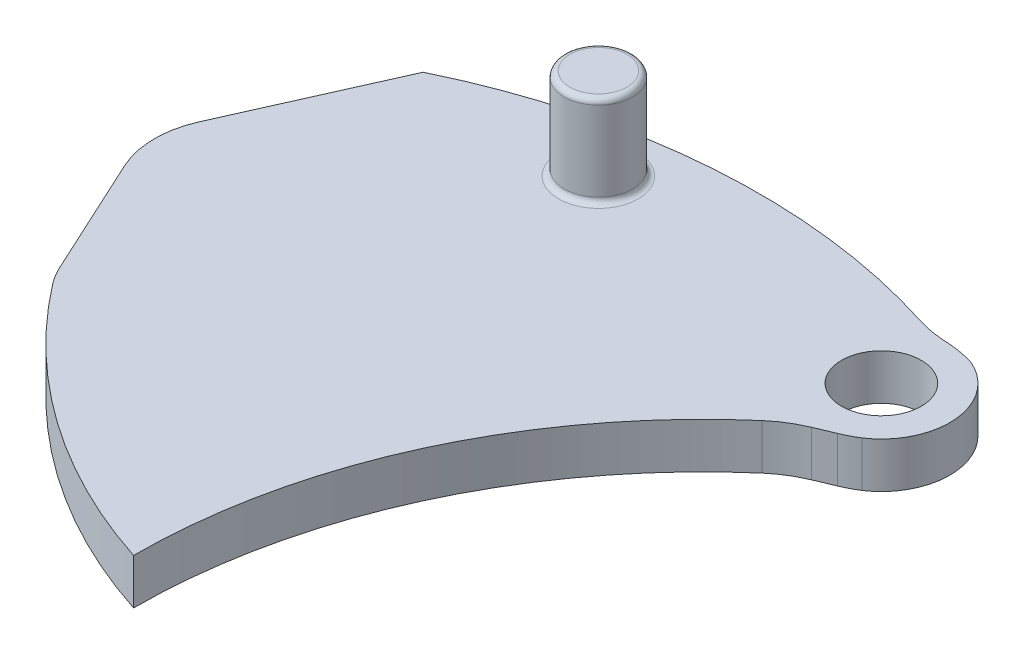
ISO-10303-21;
HEADER;
FILE_DESCRIPTION(('STEP AP214'),'2;1');
FILE_NAME('part.step','',(''),(''),'','','');
FILE_SCHEMA(('AUTOMOTIVE_DESIGN { 1 0 10303 214 1 1 1 1 }'));
ENDSEC;
DATA;
#1=APPLICATION_CONTEXT('core data for automotive mechanical design processes');
#2=APPLICATION_PROTOCOL_DEFINITION('international standard','automotive_design',2000,#1);
#3=PRODUCT_CONTEXT('',#1,'mechanical');
#4=PRODUCT('Part','Part','',(#3));
#5=PRODUCT_RELATED_PRODUCT_CATEGORY('part','',(#4));
#6=PRODUCT_DEFINITION_FORMATION('','',#4);
#7=PRODUCT_DEFINITION_CONTEXT('part definition',#1,'design');
#8=PRODUCT_DEFINITION('design','',#6,#7);
#9=PRODUCT_DEFINITION_SHAPE('','',#8);
#10=(LENGTH_UNIT() NAMED_UNIT(*) SI_UNIT(.MILLI.,.METRE.));
#11=(NAMED_UNIT(*) PLANE_ANGLE_UNIT() SI_UNIT($,.RADIAN.));
#12=(NAMED_UNIT(*) SI_UNIT($,.STERADIAN.) SOLID_ANGLE_UNIT());
#13=UNCERTAINTY_MEASURE_WITH_UNIT(LENGTH_MEASURE(1.E-05),#10,'distance_accuracy_value','');
#14=(GEOMETRIC_REPRESENTATION_CONTEXT(3) GLOBAL_UNCERTAINTY_ASSIGNED_CONTEXT((#13)) GLOBAL_UNIT_ASSIGNED_CONTEXT((#10,
#11,#12)) REPRESENTATION_CONTEXT('',''));
#15=CARTESIAN_POINT('',(0.,0.,0.));
#16=DIRECTION('',(0.,0.,1.));
#17=DIRECTION('',(1.,0.,0.));
#18=AXIS2_PLACEMENT_3D('',#15,#16,#17);
#19=CARTESIAN_POINT('',(7.72542485937361,2.,-23.7764129073789));
#20=DIRECTION('',(0.,-1.,0.));
#21=DIRECTION('',(0.,0.,-1.));
#22=AXIS2_PLACEMENT_3D('',#19,#20,#21);
#23=CYLINDRICAL_SURFACE('',#22,25.);
#24=CARTESIAN_POINT('',(7.72542485937361,2.,-23.7764129073789));
#25=DIRECTION('',(0.,1.,0.));
#26=DIRECTION('',(0.,0.,1.));
#27=AXIS2_PLACEMENT_3D('',#24,#25,#26);
#28=CIRCLE('',#27,25.);
#29=CARTESIAN_POINT('',(-12.1043119251596,2.,-8.55203971646783));
#30=VERTEX_POINT('',#29);
#31=CARTESIAN_POINT('',(0.,2.,0.));
#32=VERTEX_POINT('',#31);
#33=EDGE_CURVE('E332',#30,#32,#28,.T.);
#34=ORIENTED_EDGE('',*,*,#33,.F.);
#35=DIRECTION('',(0.,-1.,0.));
#36=VECTOR('',#35,1.);
#37=CARTESIAN_POINT('',(-12.1043119251596,2.,-8.55203971646783));
#38=LINE('',#37,#36);
#39=CARTESIAN_POINT('',(-12.1043119251596,0.,-8.55203971646783));
#40=VERTEX_POINT('',#39);
#41=EDGE_CURVE('E195',#30,#40,#38,.T.);
#42=ORIENTED_EDGE('',*,*,#41,.T.);
#43=CARTESIAN_POINT('',(7.72542485937361,0.,-23.7764129073789));
#44=DIRECTION('',(0.,1.,0.));
#45=DIRECTION('',(0.,0.,1.));
#46=AXIS2_PLACEMENT_3D('',#43,#44,#45);
#47=CIRCLE('',#46,25.);
#48=CARTESIAN_POINT('',(0.,0.,0.));
#49=VERTEX_POINT('',#48);
#50=EDGE_CURVE('E328',#40,#49,#47,.T.);
#51=ORIENTED_EDGE('',*,*,#50,.T.);
#52=DIRECTION('',(0.,-1.,0.));
#53=VECTOR('',#52,1.);
#54=CARTESIAN_POINT('',(0.,2.,0.));
#55=LINE('',#54,#53);
#56=EDGE_CURVE('E343',#32,#49,#55,.T.);
#57=ORIENTED_EDGE('',*,*,#56,.F.);
#58=EDGE_LOOP('',(#34,#42,#51,#57));
#59=FACE_BOUND('',#58,.T.);
#60=ADVANCED_FACE('F39',(#59),#23,.T.);
#61=CARTESIAN_POINT('',(0.,2.,0.));
#62=DIRECTION('',(0.,-1.,0.));
#63=DIRECTION('',(0.,0.,-1.));
#64=AXIS2_PLACEMENT_3D('',#61,#62,#63);
#65=CYLINDRICAL_SURFACE('',#64,27.5);
#66=CARTESIAN_POINT('',(0.,2.,0.));
#67=DIRECTION('',(0.,1.,0.));
#68=DIRECTION('',(0.,0.,1.));
#69=AXIS2_PLACEMENT_3D('',#66,#67,#68);
#70=CIRCLE('',#69,27.5);
#71=CARTESIAN_POINT('',(8.35088906507158,2.,-26.2013864484853));
#72=VERTEX_POINT('',#71);
#73=CARTESIAN_POINT('',(-12.0207457016555,2.,-24.7336142279314));
#74=VERTEX_POINT('',#73);
#75=EDGE_CURVE('E340',#72,#74,#70,.T.);
#76=ORIENTED_EDGE('',*,*,#75,.F.);
#77=DIRECTION('',(0.,-1.,0.));
#78=VECTOR('',#77,1.);
#79=CARTESIAN_POINT('',(8.35088906507158,2.,-26.2013864484853));
#80=LINE('',#79,#78);
#81=CARTESIAN_POINT('',(8.35088906507158,0.,-26.2013864484853));
#82=VERTEX_POINT('',#81);
#83=EDGE_CURVE('E372',#72,#82,#80,.T.);
#84=ORIENTED_EDGE('',*,*,#83,.T.);
#85=CARTESIAN_POINT('',(0.,0.,0.));
#86=DIRECTION('',(0.,1.,0.));
#87=DIRECTION('',(0.,0.,1.));
#88=AXIS2_PLACEMENT_3D('',#85,#86,#87);
#89=CIRCLE('',#88,27.5);
#90=CARTESIAN_POINT('',(-12.0207457016555,0.,-24.7336142279314));
#91=VERTEX_POINT('',#90);
#92=EDGE_CURVE('E336',#82,#91,#89,.T.);
#93=ORIENTED_EDGE('',*,*,#92,.T.);
#94=DIRECTION('',(0.,1.,0.));
#95=VECTOR('',#94,1.);
#96=CARTESIAN_POINT('',(-12.0207457016555,-0.00100000000000013,-24.7336142279314));
#97=LINE('',#96,#95);
#98=EDGE_CURVE('E319',#91,#74,#97,.T.);
#99=ORIENTED_EDGE('',*,*,#98,.T.);
#100=EDGE_LOOP('',(#76,#84,#93,#99));
#101=FACE_BOUND('',#100,.T.);
#102=ADVANCED_FACE('F247',(#101),#65,.T.);
#103=CARTESIAN_POINT('',(16.3627124296868,2.,-11.8882064536894));
#104=DIRECTION('',(0.,1.,0.));
#105=DIRECTION('',(0.,0.,1.));
#106=AXIS2_PLACEMENT_3D('',#103,#104,#105);
#107=PLANE('',#106);
#108=CARTESIAN_POINT('',(-4.22686810681053,2.,-24.6400808847623));
#109=DIRECTION('',(0.,1.,0.));
#110=DIRECTION('',(0.,0.,1.));
#111=AXIS2_PLACEMENT_3D('',#108,#109,#110);
#112=CIRCLE('',#111,1.75);
#113=CARTESIAN_POINT('',(-4.22686810681053,2.,-22.8900808847623));
#114=VERTEX_POINT('',#113);
#115=EDGE_CURVE('E11',#114,#114,#112,.F.);
#116=ORIENTED_EDGE('',*,*,#115,.T.);
#117=EDGE_LOOP('',(#116));
#118=FACE_BOUND('',#117,.T.);
#119=DIRECTION('',(-0.419636594600779,0.,-0.907692199190817));
#120=VECTOR('',#119,1.);
#121=CARTESIAN_POINT('',(-17.2255211707745,2.,-19.3960937936215));
#122=LINE('',#121,#120);
#123=CARTESIAN_POINT('',(-12.5623228363976,2.,-9.30939304861048));
#124=VERTEX_POINT('',#123);
#125=CARTESIAN_POINT('',(-15.0230330951195,2.,-14.6320163256287));
#126=VERTEX_POINT('',#125);
#127=EDGE_CURVE('E290',#124,#126,#122,.T.);
#128=ORIENTED_EDGE('',*,*,#127,.F.);
#129=CARTESIAN_POINT('',(-8.93155403963428,2.,-10.9879394270136));
#130=DIRECTION('',(0.,1.,0.));
#131=DIRECTION('',(0.,0.,1.));
#132=AXIS2_PLACEMENT_3D('',#129,#130,#131);
#133=CIRCLE('',#132,4.);
#134=EDGE_CURVE('E214',#124,#30,#133,.T.);
#135=ORIENTED_EDGE('',*,*,#134,.T.);
#136=ORIENTED_EDGE('',*,*,#33,.T.);
#137=CARTESIAN_POINT('',(25.,2.,0.));
#138=DIRECTION('',(0.,-1.,0.));
#139=DIRECTION('',(0.,0.,1.));
#140=AXIS2_PLACEMENT_3D('',#137,#138,#139);
#141=CIRCLE('',#140,25.);
#142=CARTESIAN_POINT('',(8.67065936499311,2.,-18.9302042890697));
#143=VERTEX_POINT('',#142);
#144=EDGE_CURVE('E335',#32,#143,#141,.T.);
#145=ORIENTED_EDGE('',*,*,#144,.T.);
#146=CARTESIAN_POINT('',(11.9365274919945,2.,-15.1441634312558));
#147=DIRECTION('',(0.,1.,0.));
#148=DIRECTION('',(0.,0.,1.));
#149=AXIS2_PLACEMENT_3D('',#146,#147,#148);
#150=CIRCLE('',#149,5.);
#151=CARTESIAN_POINT('',(10.005013015786,2.,-19.7560233411183));
#152=VERTEX_POINT('',#151);
#153=EDGE_CURVE('E177',#143,#152,#150,.F.);
#154=ORIENTED_EDGE('',*,*,#153,.T.);
#155=DIRECTION('',(0.922371981972501,0.,-0.3863028952417));
#156=VECTOR('',#155,1.);
#157=CARTESIAN_POINT('',(9.31398488236666,2.,-19.4666106379456));
#158=LINE('',#157,#156);
#159=CARTESIAN_POINT('',(10.8164950816599,2.,-20.0958839153884));
#160=VERTEX_POINT('',#159);
#161=EDGE_CURVE('E292',#152,#160,#158,.T.);
#162=ORIENTED_EDGE('',*,*,#161,.T.);
#163=CARTESIAN_POINT('',(8.88498060545142,2.,-24.7077438252509));
#164=DIRECTION('',(0.,1.,0.));
#165=DIRECTION('',(0.,0.,1.));
#166=AXIS2_PLACEMENT_3D('',#163,#164,#165);
#167=CIRCLE('',#166,5.);
#168=CARTESIAN_POINT('',(11.525,2.,-20.4615340334003));
#169=VERTEX_POINT('',#168);
#170=EDGE_CURVE('E183',#160,#169,#167,.T.);
#171=ORIENTED_EDGE('',*,*,#170,.T.);
#172=CARTESIAN_POINT('',(9.87500000000001,2.,-22.9670279966738));
#173=DIRECTION('',(0.,1.,0.));
#174=DIRECTION('',(0.,0.,1.));
#175=AXIS2_PLACEMENT_3D('',#172,#173,#174);
#176=CIRCLE('',#175,3.);
#177=CARTESIAN_POINT('',(11.06,2.,-25.7230713562747));
#178=VERTEX_POINT('',#177);
#179=EDGE_CURVE('E152',#169,#178,#176,.T.);
#180=ORIENTED_EDGE('',*,*,#179,.T.);
#181=CARTESIAN_POINT('',(9.5195320911294,2.,-20.9662910773739));
#182=DIRECTION('',(0.,1.,0.));
#183=DIRECTION('',(0.,0.,1.));
#184=AXIS2_PLACEMENT_3D('',#181,#182,#183);
#185=CIRCLE('',#184,5.);
#186=CARTESIAN_POINT('',(9.85368730869747,2.,-25.9551126106192));
#187=VERTEX_POINT('',#186);
#188=EDGE_CURVE('E375',#178,#187,#185,.T.);
#189=ORIENTED_EDGE('',*,*,#188,.T.);
#190=DIRECTION('',(-0.997764306649061,0.,-0.0668310435136145));
#191=VECTOR('',#190,1.);
#192=CARTESIAN_POINT('',(8.90363801881755,2.,-26.0187476645181));
#193=LINE('',#192,#191);
#194=CARTESIAN_POINT('',(9.53507731388016,2.,-25.9764533604191));
#195=VERTEX_POINT('',#194);
#196=EDGE_CURVE('E301',#187,#195,#193,.T.);
#197=ORIENTED_EDGE('',*,*,#196,.T.);
#198=CARTESIAN_POINT('',(9.86923253144823,2.,-30.9652748936644));
#199=DIRECTION('',(0.,1.,0.));
#200=DIRECTION('',(0.,0.,1.));
#201=AXIS2_PLACEMENT_3D('',#198,#199,#200);
#202=CIRCLE('',#201,5.);
#203=EDGE_CURVE('E189',#195,#72,#202,.F.);
#204=ORIENTED_EDGE('',*,*,#203,.T.);
#205=ORIENTED_EDGE('',*,*,#75,.T.);
#206=DIRECTION('',(-0.406723130948702,0.,0.913551473509449));
#207=VECTOR('',#206,1.);
#208=CARTESIAN_POINT('',(-19.2223133299624,2.,-8.55798462193427));
#209=LINE('',#208,#207);
#210=CARTESIAN_POINT('',(-15.0464701923941,2.,-17.9374552278266));
#211=VERTEX_POINT('',#210);
#212=EDGE_CURVE('E316',#74,#211,#209,.T.);
#213=ORIENTED_EDGE('',*,*,#212,.T.);
#214=CARTESIAN_POINT('',(-11.3922642983563,2.,-16.3105627040318));
#215=DIRECTION('',(0.,1.,0.));
#216=DIRECTION('',(0.,0.,1.));
#217=AXIS2_PLACEMENT_3D('',#214,#215,#216);
#218=CIRCLE('',#217,4.);
#219=EDGE_CURVE('E62',#211,#126,#218,.T.);
#220=ORIENTED_EDGE('',*,*,#219,.T.);
#221=EDGE_LOOP('',(#128,#135,#136,#145,#154,#162,#171,#180,#189,#197,#204,#205,#213,#220));
#222=FACE_BOUND('',#221,.T.);
#223=CARTESIAN_POINT('',(9.87500000000001,2.,-22.9670279966738));
#224=DIRECTION('',(0.,1.,0.));
#225=DIRECTION('',(0.,0.,1.));
#226=AXIS2_PLACEMENT_3D('',#223,#224,#225);
#227=CIRCLE('',#226,1.75);
#228=CARTESIAN_POINT('',(9.87500000000001,2.,-21.2170279966738));
#229=VERTEX_POINT('',#228);
#230=EDGE_CURVE('E323',#229,#229,#227,.T.);
#231=ORIENTED_EDGE('',*,*,#230,.F.);
#232=EDGE_LOOP('',(#231));
#233=FACE_BOUND('',#232,.T.);
#234=ADVANCED_FACE('F253',(#118,#222,#233),#107,.T.);
#235=CARTESIAN_POINT('',(16.3627124296868,0.,-11.8882064536894));
#236=DIRECTION('',(0.,1.,0.));
#237=DIRECTION('',(0.,0.,1.));
#238=AXIS2_PLACEMENT_3D('',#235,#236,#237);
#239=PLANE('',#238);
#240=ORIENTED_EDGE('',*,*,#50,.F.);
#241=CARTESIAN_POINT('',(-8.93155403963428,0.,-10.9879394270136));
#242=DIRECTION('',(0.,1.,0.));
#243=DIRECTION('',(0.,0.,1.));
#244=AXIS2_PLACEMENT_3D('',#241,#242,#243);
#245=CIRCLE('',#244,4.);
#246=CARTESIAN_POINT('',(-12.5623228363976,0.,-9.30939304861048));
#247=VERTEX_POINT('',#246);
#248=EDGE_CURVE('E202',#40,#247,#245,.F.);
#249=ORIENTED_EDGE('',*,*,#248,.T.);
#250=DIRECTION('',(-0.419636594600779,0.,-0.907692199190817));
#251=VECTOR('',#250,1.);
#252=CARTESIAN_POINT('',(-17.2255211707745,0.,-19.3960937936215));
#253=LINE('',#252,#251);
#254=CARTESIAN_POINT('',(-15.0230330951195,0.,-14.6320163256287));
#255=VERTEX_POINT('',#254);
#256=EDGE_CURVE('E288',#247,#255,#253,.T.);
#257=ORIENTED_EDGE('',*,*,#256,.T.);
#258=CARTESIAN_POINT('',(-11.3922642983563,0.,-16.3105627040318));
#259=DIRECTION('',(0.,1.,0.));
#260=DIRECTION('',(0.,0.,1.));
#261=AXIS2_PLACEMENT_3D('',#258,#259,#260);
#262=CIRCLE('',#261,4.);
#263=CARTESIAN_POINT('',(-15.0464701923941,0.,-17.9374552278266));
#264=VERTEX_POINT('',#263);
#265=EDGE_CURVE('E199',#255,#264,#262,.F.);
#266=ORIENTED_EDGE('',*,*,#265,.T.);
#267=DIRECTION('',(0.406723130948702,0.,-0.913551473509449));
#268=VECTOR('',#267,1.);
#269=CARTESIAN_POINT('',(-19.2223133299624,0.,-8.55798462193427));
#270=LINE('',#269,#268);
#271=EDGE_CURVE('E312',#264,#91,#270,.T.);
#272=ORIENTED_EDGE('',*,*,#271,.T.);
#273=ORIENTED_EDGE('',*,*,#92,.F.);
#274=CARTESIAN_POINT('',(9.86923253144823,0.,-30.9652748936644));
#275=DIRECTION('',(0.,1.,0.));
#276=DIRECTION('',(0.,0.,1.));
#277=AXIS2_PLACEMENT_3D('',#274,#275,#276);
#278=CIRCLE('',#277,5.);
#279=CARTESIAN_POINT('',(9.53507731388016,0.,-25.9764533604191));
#280=VERTEX_POINT('',#279);
#281=EDGE_CURVE('E192',#82,#280,#278,.T.);
#282=ORIENTED_EDGE('',*,*,#281,.T.);
#283=DIRECTION('',(-0.997764306649061,0.,-0.0668310435136145));
#284=VECTOR('',#283,1.);
#285=CARTESIAN_POINT('',(8.90363801881755,0.,-26.0187476645181));
#286=LINE('',#285,#284);
#287=CARTESIAN_POINT('',(9.85368730869747,0.,-25.9551126106192));
#288=VERTEX_POINT('',#287);
#289=EDGE_CURVE('E157',#288,#280,#286,.T.);
#290=ORIENTED_EDGE('',*,*,#289,.F.);
#291=CARTESIAN_POINT('',(9.5195320911294,0.,-20.9662910773739));
#292=DIRECTION('',(0.,1.,0.));
#293=DIRECTION('',(0.,0.,1.));
#294=AXIS2_PLACEMENT_3D('',#291,#292,#293);
#295=CIRCLE('',#294,5.);
#296=CARTESIAN_POINT('',(11.06,0.,-25.7230713562747));
#297=VERTEX_POINT('',#296);
#298=EDGE_CURVE('E168',#288,#297,#295,.F.);
#299=ORIENTED_EDGE('',*,*,#298,.T.);
#300=CARTESIAN_POINT('',(9.87500000000001,0.,-22.9670279966738));
#301=DIRECTION('',(0.,1.,0.));
#302=DIRECTION('',(0.,0.,1.));
#303=AXIS2_PLACEMENT_3D('',#300,#301,#302);
#304=CIRCLE('',#303,3.);
#305=CARTESIAN_POINT('',(11.525,0.,-20.4615340334003));
#306=VERTEX_POINT('',#305);
#307=EDGE_CURVE('E149',#306,#297,#304,.T.);
#308=ORIENTED_EDGE('',*,*,#307,.F.);
#309=CARTESIAN_POINT('',(8.88498060545142,0.,-24.7077438252509));
#310=DIRECTION('',(0.,1.,0.));
#311=DIRECTION('',(0.,0.,1.));
#312=AXIS2_PLACEMENT_3D('',#309,#310,#311);
#313=CIRCLE('',#312,5.);
#314=CARTESIAN_POINT('',(10.8164950816599,0.,-20.0958839153884));
#315=VERTEX_POINT('',#314);
#316=EDGE_CURVE('E164',#306,#315,#313,.F.);
#317=ORIENTED_EDGE('',*,*,#316,.T.);
#318=DIRECTION('',(0.922371981972501,0.,-0.3863028952417));
#319=VECTOR('',#318,1.);
#320=CARTESIAN_POINT('',(9.31398488236666,0.,-19.4666106379456));
#321=LINE('',#320,#319);
#322=CARTESIAN_POINT('',(10.005013015786,0.,-19.7560233411183));
#323=VERTEX_POINT('',#322);
#324=EDGE_CURVE('E170',#323,#315,#321,.T.);
#325=ORIENTED_EDGE('',*,*,#324,.F.);
#326=CARTESIAN_POINT('',(11.9365274919945,0.,-15.1441634312558));
#327=DIRECTION('',(0.,1.,0.));
#328=DIRECTION('',(0.,0.,1.));
#329=AXIS2_PLACEMENT_3D('',#326,#327,#328);
#330=CIRCLE('',#329,5.);
#331=CARTESIAN_POINT('',(8.67065936499311,0.,-18.9302042890697));
#332=VERTEX_POINT('',#331);
#333=EDGE_CURVE('E181',#323,#332,#330,.T.);
#334=ORIENTED_EDGE('',*,*,#333,.T.);
#335=CARTESIAN_POINT('',(25.,0.,0.));
#336=DIRECTION('',(0.,-1.,0.));
#337=DIRECTION('',(0.,0.,1.));
#338=AXIS2_PLACEMENT_3D('',#335,#336,#337);
#339=CIRCLE('',#338,25.);
#340=EDGE_CURVE('E346',#49,#332,#339,.T.);
#341=ORIENTED_EDGE('',*,*,#340,.F.);
#342=EDGE_LOOP('',(#240,#249,#257,#266,#272,#273,#282,#290,#299,#308,#317,#325,#334,#341));
#343=FACE_BOUND('',#342,.T.);
#344=CARTESIAN_POINT('',(9.87500000000001,0.,-22.9670279966738));
#345=DIRECTION('',(0.,1.,0.));
#346=DIRECTION('',(0.,0.,1.));
#347=AXIS2_PLACEMENT_3D('',#344,#345,#346);
#348=CIRCLE('',#347,1.75);
#349=CARTESIAN_POINT('',(9.87500000000001,0.,-21.2170279966738));
#350=VERTEX_POINT('',#349);
#351=EDGE_CURVE('E324',#350,#350,#348,.T.);
#352=ORIENTED_EDGE('',*,*,#351,.T.);
#353=EDGE_LOOP('',(#352));
#354=FACE_BOUND('',#353,.T.);
#355=ADVANCED_FACE('F161',(#343,#354),#239,.F.);
#356=CARTESIAN_POINT('',(25.,2.,0.));
#357=DIRECTION('',(0.,-1.,0.));
#358=DIRECTION('',(0.,0.,-1.));
#359=AXIS2_PLACEMENT_3D('',#356,#357,#358);
#360=CYLINDRICAL_SURFACE('',#359,25.);
#361=ORIENTED_EDGE('',*,*,#340,.T.);
#362=DIRECTION('',(0.,-1.,0.));
#363=VECTOR('',#362,1.);
#364=CARTESIAN_POINT('',(8.67065936499311,2.,-18.9302042890697));
#365=LINE('',#364,#363);
#366=EDGE_CURVE('E356',#332,#143,#365,.F.);
#367=ORIENTED_EDGE('',*,*,#366,.T.);
#368=ORIENTED_EDGE('',*,*,#144,.F.);
#369=ORIENTED_EDGE('',*,*,#56,.T.);
#370=EDGE_LOOP('',(#361,#367,#368,#369));
#371=FACE_BOUND('',#370,.T.);
#372=ADVANCED_FACE('F259',(#371),#360,.F.);
#373=CARTESIAN_POINT('',(9.87500000000001,0.,-22.9670279966738));
#374=DIRECTION('',(0.,1.,0.));
#375=DIRECTION('',(0.,0.,1.));
#376=AXIS2_PLACEMENT_3D('',#373,#374,#375);
#377=CYLINDRICAL_SURFACE('',#376,1.75);
#378=ORIENTED_EDGE('',*,*,#351,.F.);
#379=EDGE_LOOP('',(#378));
#380=FACE_BOUND('',#379,.T.);
#381=ORIENTED_EDGE('',*,*,#230,.T.);
#382=EDGE_LOOP('',(#381));
#383=FACE_BOUND('',#382,.T.);
#384=ADVANCED_FACE('F391',(#380,#383),#377,.F.);
#385=CARTESIAN_POINT('',(-19.2223133299624,-0.00100000000000013,-8.55798462193427));
#386=DIRECTION('',(-0.913551473509449,0.,-0.406723130948702));
#387=DIRECTION('',(-0.406723130948702,0.,0.913551473509449));
#388=AXIS2_PLACEMENT_3D('',#385,#386,#387);
#389=PLANE('',#388);
#390=ORIENTED_EDGE('',*,*,#271,.F.);
#391=DIRECTION('',(0.,-1.,0.));
#392=VECTOR('',#391,1.);
#393=CARTESIAN_POINT('',(-15.0464701923941,2.,-17.9374552278266));
#394=LINE('',#393,#392);
#395=EDGE_CURVE('E55',#264,#211,#394,.F.);
#396=ORIENTED_EDGE('',*,*,#395,.T.);
#397=ORIENTED_EDGE('',*,*,#212,.F.);
#398=ORIENTED_EDGE('',*,*,#98,.F.);
#399=EDGE_LOOP('',(#390,#396,#397,#398));
#400=FACE_BOUND('',#399,.T.);
#401=ADVANCED_FACE('F396',(#400),#389,.T.);
#402=CARTESIAN_POINT('',(8.90363801881755,0.,-26.0187476645181));
#403=DIRECTION('',(0.0668310435136145,0.,-0.997764306649061));
#404=DIRECTION('',(-0.997764306649061,0.,-0.0668310435136145));
#405=AXIS2_PLACEMENT_3D('',#402,#403,#404);
#406=PLANE('',#405);
#407=ORIENTED_EDGE('',*,*,#289,.T.);
#408=DIRECTION('',(0.,-1.,0.));
#409=VECTOR('',#408,1.);
#410=CARTESIAN_POINT('',(9.53507731388016,0.,-25.9764533604191));
#411=LINE('',#410,#409);
#412=EDGE_CURVE('E368',#280,#195,#411,.F.);
#413=ORIENTED_EDGE('',*,*,#412,.T.);
#414=ORIENTED_EDGE('',*,*,#196,.F.);
#415=DIRECTION('',(0.,-1.,0.));
#416=VECTOR('',#415,1.);
#417=CARTESIAN_POINT('',(9.85368730869747,0.,-25.9551126106192));
#418=LINE('',#417,#416);
#419=EDGE_CURVE('E365',#187,#288,#418,.T.);
#420=ORIENTED_EDGE('',*,*,#419,.T.);
#421=EDGE_LOOP('',(#407,#413,#414,#420));
#422=FACE_BOUND('',#421,.T.);
#423=ADVANCED_FACE('F408',(#422),#406,.T.);
#424=CARTESIAN_POINT('',(9.87500000000001,0.,-22.9670279966738));
#425=DIRECTION('',(0.,1.,0.));
#426=DIRECTION('',(0.,0.,1.));
#427=AXIS2_PLACEMENT_3D('',#424,#425,#426);
#428=CYLINDRICAL_SURFACE('',#427,3.);
#429=ORIENTED_EDGE('',*,*,#179,.F.);
#430=DIRECTION('',(0.,1.,0.));
#431=VECTOR('',#430,1.);
#432=CARTESIAN_POINT('',(11.525,0.,-20.4615340334003));
#433=LINE('',#432,#431);
#434=EDGE_CURVE('E145',#306,#169,#433,.T.);
#435=ORIENTED_EDGE('',*,*,#434,.F.);
#436=ORIENTED_EDGE('',*,*,#307,.T.);
#437=DIRECTION('',(0.,1.,0.));
#438=VECTOR('',#437,1.);
#439=CARTESIAN_POINT('',(11.06,0.,-25.7230713562747));
#440=LINE('',#439,#438);
#441=EDGE_CURVE('E156',#297,#178,#440,.T.);
#442=ORIENTED_EDGE('',*,*,#441,.T.);
#443=EDGE_LOOP('',(#429,#435,#436,#442));
#444=FACE_BOUND('',#443,.T.);
#445=ADVANCED_FACE('F147',(#444),#428,.T.);
#446=CARTESIAN_POINT('',(9.31398488236666,0.,-19.4666106379456));
#447=DIRECTION('',(0.3863028952417,0.,0.922371981972501));
#448=DIRECTION('',(0.922371981972501,0.,-0.3863028952417));
#449=AXIS2_PLACEMENT_3D('',#446,#447,#448);
#450=PLANE('',#449);
#451=ORIENTED_EDGE('',*,*,#161,.F.);
#452=DIRECTION('',(0.,-1.,0.));
#453=VECTOR('',#452,1.);
#454=CARTESIAN_POINT('',(10.005013015786,0.,-19.7560233411183));
#455=LINE('',#454,#453);
#456=EDGE_CURVE('E362',#152,#323,#455,.T.);
#457=ORIENTED_EDGE('',*,*,#456,.T.);
#458=ORIENTED_EDGE('',*,*,#324,.T.);
#459=DIRECTION('',(0.,-1.,0.));
#460=VECTOR('',#459,1.);
#461=CARTESIAN_POINT('',(10.8164950816599,2.,-20.0958839153884));
#462=LINE('',#461,#460);
#463=EDGE_CURVE('E175',#315,#160,#462,.F.);
#464=ORIENTED_EDGE('',*,*,#463,.T.);
#465=EDGE_LOOP('',(#451,#457,#458,#464));
#466=FACE_BOUND('',#465,.T.);
#467=ADVANCED_FACE('F264',(#466),#450,.T.);
#468=CARTESIAN_POINT('',(11.9365274919945,2.,-15.1441634312558));
#469=DIRECTION('',(0.,-1.,0.));
#470=DIRECTION('',(0.,0.,-1.));
#471=AXIS2_PLACEMENT_3D('',#468,#469,#470);
#472=CYLINDRICAL_SURFACE('',#471,5.);
#473=ORIENTED_EDGE('',*,*,#333,.F.);
#474=ORIENTED_EDGE('',*,*,#456,.F.);
#475=ORIENTED_EDGE('',*,*,#153,.F.);
#476=ORIENTED_EDGE('',*,*,#366,.F.);
#477=EDGE_LOOP('',(#473,#474,#475,#476));
#478=FACE_BOUND('',#477,.T.);
#479=ADVANCED_FACE('F260',(#478),#472,.F.);
#480=CARTESIAN_POINT('',(9.86923253144823,2.,-30.9652748936644));
#481=DIRECTION('',(0.,-1.,0.));
#482=DIRECTION('',(0.,0.,-1.));
#483=AXIS2_PLACEMENT_3D('',#480,#481,#482);
#484=CYLINDRICAL_SURFACE('',#483,5.);
#485=ORIENTED_EDGE('',*,*,#281,.F.);
#486=ORIENTED_EDGE('',*,*,#83,.F.);
#487=ORIENTED_EDGE('',*,*,#203,.F.);
#488=ORIENTED_EDGE('',*,*,#412,.F.);
#489=EDGE_LOOP('',(#485,#486,#487,#488));
#490=FACE_BOUND('',#489,.T.);
#491=ADVANCED_FACE('F263',(#490),#484,.F.);
#492=CARTESIAN_POINT('',(8.88498060545142,0.,-24.7077438252509));
#493=DIRECTION('',(0.,1.,0.));
#494=DIRECTION('',(0.,0.,1.));
#495=AXIS2_PLACEMENT_3D('',#492,#493,#494);
#496=CYLINDRICAL_SURFACE('',#495,5.);
#497=ORIENTED_EDGE('',*,*,#316,.F.);
#498=ORIENTED_EDGE('',*,*,#434,.T.);
#499=ORIENTED_EDGE('',*,*,#170,.F.);
#500=ORIENTED_EDGE('',*,*,#463,.F.);
#501=EDGE_LOOP('',(#497,#498,#499,#500));
#502=FACE_BOUND('',#501,.T.);
#503=ADVANCED_FACE('F173',(#502),#496,.T.);
#504=CARTESIAN_POINT('',(9.5195320911294,0.,-20.9662910773739));
#505=DIRECTION('',(0.,1.,0.));
#506=DIRECTION('',(0.,0.,1.));
#507=AXIS2_PLACEMENT_3D('',#504,#505,#506);
#508=CYLINDRICAL_SURFACE('',#507,5.);
#509=ORIENTED_EDGE('',*,*,#298,.F.);
#510=ORIENTED_EDGE('',*,*,#419,.F.);
#511=ORIENTED_EDGE('',*,*,#188,.F.);
#512=ORIENTED_EDGE('',*,*,#441,.F.);
#513=EDGE_LOOP('',(#509,#510,#511,#512));
#514=FACE_BOUND('',#513,.T.);
#515=ADVANCED_FACE('F271',(#514),#508,.T.);
#516=CARTESIAN_POINT('',(-17.2255211707745,0.,-19.3960937936215));
#517=DIRECTION('',(0.907692199190817,0.,-0.419636594600779));
#518=DIRECTION('',(-0.41963659460078,0.,-0.907692199190817));
#519=AXIS2_PLACEMENT_3D('',#516,#517,#518);
#520=PLANE('',#519);
#521=ORIENTED_EDGE('',*,*,#256,.F.);
#522=DIRECTION('',(0.,-1.,0.));
#523=VECTOR('',#522,1.);
#524=CARTESIAN_POINT('',(-12.5623228363975,0.,-9.30939304861047));
#525=LINE('',#524,#523);
#526=EDGE_CURVE('E209',#247,#124,#525,.F.);
#527=ORIENTED_EDGE('',*,*,#526,.T.);
#528=ORIENTED_EDGE('',*,*,#127,.T.);
#529=DIRECTION('',(0.,-1.,0.));
#530=VECTOR('',#529,1.);
#531=CARTESIAN_POINT('',(-15.0230330951195,0.,-14.6320163256287));
#532=LINE('',#531,#530);
#533=EDGE_CURVE('E205',#126,#255,#532,.T.);
#534=ORIENTED_EDGE('',*,*,#533,.T.);
#535=EDGE_LOOP('',(#521,#527,#528,#534));
#536=FACE_BOUND('',#535,.T.);
#537=ADVANCED_FACE('F274',(#536),#520,.F.);
#538=CARTESIAN_POINT('',(-8.93155403963428,2.,-10.9879394270136));
#539=DIRECTION('',(0.,-1.,0.));
#540=DIRECTION('',(0.,0.,-1.));
#541=AXIS2_PLACEMENT_3D('',#538,#539,#540);
#542=CYLINDRICAL_SURFACE('',#541,4.);
#543=ORIENTED_EDGE('',*,*,#134,.F.);
#544=ORIENTED_EDGE('',*,*,#526,.F.);
#545=ORIENTED_EDGE('',*,*,#248,.F.);
#546=ORIENTED_EDGE('',*,*,#41,.F.);
#547=EDGE_LOOP('',(#543,#544,#545,#546));
#548=FACE_BOUND('',#547,.T.);
#549=ADVANCED_FACE('F276',(#548),#542,.T.);
#550=CARTESIAN_POINT('',(-11.3922642983563,0.,-16.3105627040318));
#551=DIRECTION('',(0.,1.,0.));
#552=DIRECTION('',(0.,0.,1.));
#553=AXIS2_PLACEMENT_3D('',#550,#551,#552);
#554=CYLINDRICAL_SURFACE('',#553,4.);
#555=ORIENTED_EDGE('',*,*,#219,.F.);
#556=ORIENTED_EDGE('',*,*,#395,.F.);
#557=ORIENTED_EDGE('',*,*,#265,.F.);
#558=ORIENTED_EDGE('',*,*,#533,.F.);
#559=EDGE_LOOP('',(#555,#556,#557,#558));
#560=FACE_BOUND('',#559,.T.);
#561=ADVANCED_FACE('F244',(#560),#554,.T.);
#562=CARTESIAN_POINT('',(-4.22686810681053,6.,-24.6400808847623));
#563=DIRECTION('',(0.,-1.,0.));
#564=DIRECTION('',(0.,0.,-1.));
#565=AXIS2_PLACEMENT_3D('',#562,#563,#564);
#566=CYLINDRICAL_SURFACE('',#565,1.5);
#567=CARTESIAN_POINT('',(-4.22686810681053,5.75,-24.6400808847623));
#568=DIRECTION('',(0.,1.,0.));
#569=DIRECTION('',(0.,0.,1.));
#570=AXIS2_PLACEMENT_3D('',#567,#568,#569);
#571=CIRCLE('',#570,1.5);
#572=CARTESIAN_POINT('',(-4.22686810681053,5.75,-23.1400808847623));
#573=VERTEX_POINT('',#572);
#574=EDGE_CURVE('E48',#573,#573,#571,.F.);
#575=ORIENTED_EDGE('',*,*,#574,.T.);
#576=EDGE_LOOP('',(#575));
#577=FACE_BOUND('',#576,.T.);
#578=CARTESIAN_POINT('',(-4.22686810681053,2.25,-24.6400808847623));
#579=DIRECTION('',(0.,1.,0.));
#580=DIRECTION('',(0.,0.,1.));
#581=AXIS2_PLACEMENT_3D('',#578,#579,#580);
#582=CIRCLE('',#581,1.5);
#583=CARTESIAN_POINT('',(-4.22686810681053,2.25,-23.1400808847623));
#584=VERTEX_POINT('',#583);
#585=EDGE_CURVE('E223',#584,#584,#582,.T.);
#586=ORIENTED_EDGE('',*,*,#585,.T.);
#587=EDGE_LOOP('',(#586));
#588=FACE_BOUND('',#587,.T.);
#589=ADVANCED_FACE('F230',(#577,#588),#566,.T.);
#590=CARTESIAN_POINT('',(-4.22686810681053,6.,-24.6400808847623));
#591=DIRECTION('',(0.,1.,0.));
#592=DIRECTION('',(0.,0.,1.));
#593=AXIS2_PLACEMENT_3D('',#590,#591,#592);
#594=PLANE('',#593);
#595=CARTESIAN_POINT('',(-4.22686810681053,6.,-24.6400808847623));
#596=DIRECTION('',(0.,1.,0.));
#597=DIRECTION('',(0.,0.,1.));
#598=AXIS2_PLACEMENT_3D('',#595,#596,#597);
#599=CIRCLE('',#598,1.25);
#600=CARTESIAN_POINT('',(-4.22686810681053,6.,-23.3900808847623));
#601=VERTEX_POINT('',#600);
#602=EDGE_CURVE('E219',#601,#601,#599,.T.);
#603=ORIENTED_EDGE('',*,*,#602,.T.);
#604=EDGE_LOOP('',(#603));
#605=FACE_BOUND('',#604,.T.);
#606=ADVANCED_FACE('F236',(#605),#594,.T.);
#607=CARTESIAN_POINT('',(-4.22686810681053,5.75,-24.6400808847623));
#608=DIRECTION('',(0.,1.,0.));
#609=DIRECTION('',(0.,0.,1.));
#610=AXIS2_PLACEMENT_3D('',#607,#608,#609);
#611=TOROIDAL_SURFACE('',#610,1.25,0.25);
#612=ORIENTED_EDGE('',*,*,#574,.F.);
#613=EDGE_LOOP('',(#612));
#614=FACE_BOUND('',#613,.T.);
#615=ORIENTED_EDGE('',*,*,#602,.F.);
#616=EDGE_LOOP('',(#615));
#617=FACE_BOUND('',#616,.T.);
#618=ADVANCED_FACE('F233',(#614,#617),#611,.T.);
#619=CARTESIAN_POINT('',(-4.22686810681053,2.25,-24.6400808847623));
#620=DIRECTION('',(0.,1.,0.));
#621=DIRECTION('',(0.,0.,1.));
#622=AXIS2_PLACEMENT_3D('',#619,#620,#621);
#623=TOROIDAL_SURFACE('',#622,1.75,0.25);
#624=ORIENTED_EDGE('',*,*,#115,.F.);
#625=EDGE_LOOP('',(#624));
#626=FACE_BOUND('',#625,.T.);
#627=ORIENTED_EDGE('',*,*,#585,.F.);
#628=EDGE_LOOP('',(#627));
#629=FACE_BOUND('',#628,.T.);
#630=ADVANCED_FACE('F41',(#626,#629),#623,.F.);
#631=CLOSED_SHELL('',(#60,#102,#234,#355,#372,#384,#401,#423,#445,#467,#479,#491,#503,#515,#537,
#549,#561,#589,#606,#618,#630));
#632=MANIFOLD_SOLID_BREP('B2',#631);
#633=ADVANCED_BREP_SHAPE_REPRESENTATION('',(#18,#632),#14);
#634=SHAPE_DEFINITION_REPRESENTATION(#9,#633);
ENDSEC;
END-ISO-10303-21;
